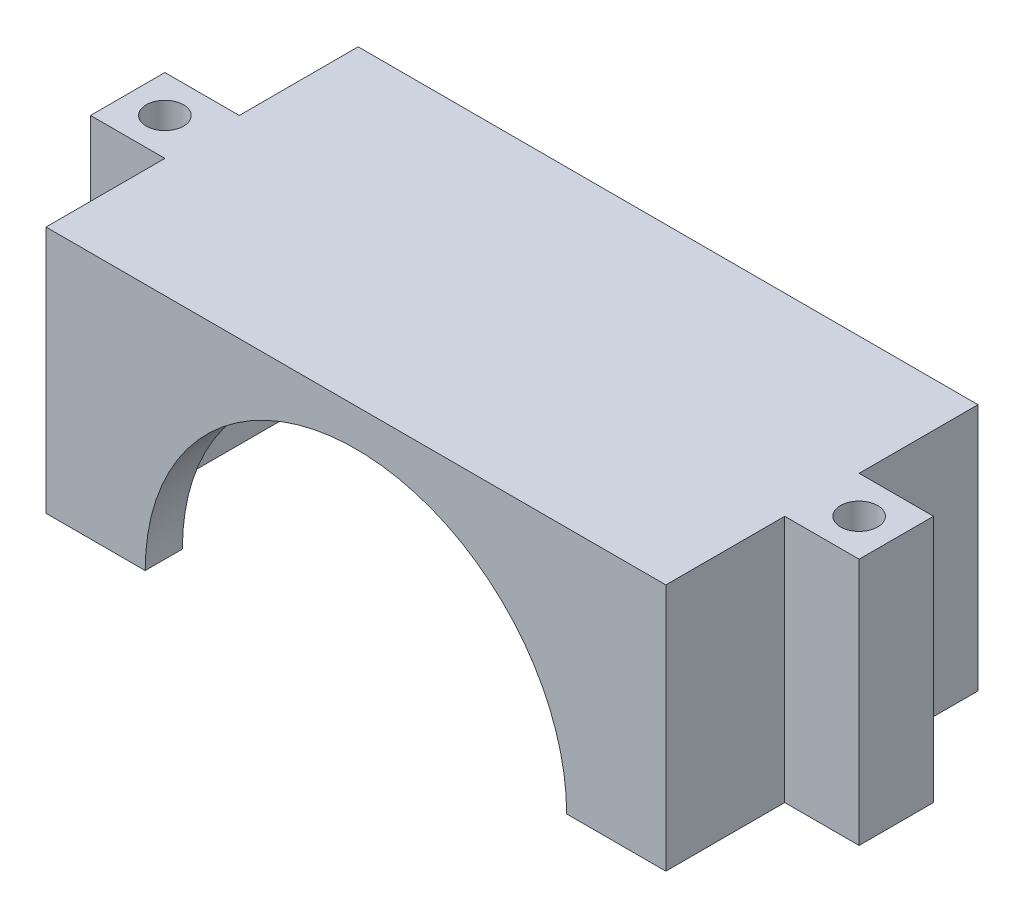
ISO-10303-21;
HEADER;
FILE_DESCRIPTION(('STEP AP214'),'2;1');
FILE_NAME('part.step','',(''),(''),'','','');
FILE_SCHEMA(('AUTOMOTIVE_DESIGN { 1 0 10303 214 1 1 1 1 }'));
ENDSEC;
DATA;
#1=APPLICATION_CONTEXT('core data for automotive mechanical design processes');
#2=APPLICATION_PROTOCOL_DEFINITION('international standard','automotive_design',2000,#1);
#3=PRODUCT_CONTEXT('',#1,'mechanical');
#4=PRODUCT('Part','Part','',(#3));
#5=PRODUCT_RELATED_PRODUCT_CATEGORY('part','',(#4));
#6=PRODUCT_DEFINITION_FORMATION('','',#4);
#7=PRODUCT_DEFINITION_CONTEXT('part definition',#1,'design');
#8=PRODUCT_DEFINITION('design','',#6,#7);
#9=PRODUCT_DEFINITION_SHAPE('','',#8);
#10=(LENGTH_UNIT() NAMED_UNIT(*) SI_UNIT(.MILLI.,.METRE.));
#11=(NAMED_UNIT(*) PLANE_ANGLE_UNIT() SI_UNIT($,.RADIAN.));
#12=(NAMED_UNIT(*) SI_UNIT($,.STERADIAN.) SOLID_ANGLE_UNIT());
#13=UNCERTAINTY_MEASURE_WITH_UNIT(LENGTH_MEASURE(1.E-05),#10,'distance_accuracy_value','');
#14=(GEOMETRIC_REPRESENTATION_CONTEXT(3) GLOBAL_UNCERTAINTY_ASSIGNED_CONTEXT((#13)) GLOBAL_UNIT_ASSIGNED_CONTEXT((#10,
#11,#12)) REPRESENTATION_CONTEXT('',''));
#15=CARTESIAN_POINT('',(0.,0.,0.));
#16=DIRECTION('',(0.,0.,1.));
#17=DIRECTION('',(1.,0.,0.));
#18=AXIS2_PLACEMENT_3D('',#15,#16,#17);
#19=CARTESIAN_POINT('',(-25.,20.,12.59));
#20=DIRECTION('',(1.,0.,0.));
#21=DIRECTION('',(0.,0.,-1.));
#22=AXIS2_PLACEMENT_3D('',#19,#20,#21);
#23=PLANE('',#22);
#24=DIRECTION('',(0.,1.,0.));
#25=VECTOR('',#24,1.);
#26=CARTESIAN_POINT('',(-25.,0.,3.));
#27=LINE('',#26,#25);
#28=CARTESIAN_POINT('',(-25.,0.,3.));
#29=VERTEX_POINT('',#28);
#30=CARTESIAN_POINT('',(-25.,20.,3.));
#31=VERTEX_POINT('',#30);
#32=EDGE_CURVE('E185',#29,#31,#27,.T.);
#33=ORIENTED_EDGE('',*,*,#32,.F.);
#34=DIRECTION('',(0.,0.,1.));
#35=VECTOR('',#34,1.);
#36=CARTESIAN_POINT('',(-25.,0.,12.59));
#37=LINE('',#36,#35);
#38=CARTESIAN_POINT('',(-25.,0.,12.59));
#39=VERTEX_POINT('',#38);
#40=EDGE_CURVE('E198',#29,#39,#37,.T.);
#41=ORIENTED_EDGE('',*,*,#40,.T.);
#42=DIRECTION('',(0.,-1.,0.));
#43=VECTOR('',#42,1.);
#44=CARTESIAN_POINT('',(-25.,20.,12.59));
#45=LINE('',#44,#43);
#46=CARTESIAN_POINT('',(-25.,20.,12.59));
#47=VERTEX_POINT('',#46);
#48=EDGE_CURVE('E235',#47,#39,#45,.T.);
#49=ORIENTED_EDGE('',*,*,#48,.F.);
#50=DIRECTION('',(0.,0.,1.));
#51=VECTOR('',#50,1.);
#52=CARTESIAN_POINT('',(-25.,20.,12.59));
#53=LINE('',#52,#51);
#54=EDGE_CURVE('E200',#31,#47,#53,.T.);
#55=ORIENTED_EDGE('',*,*,#54,.F.);
#56=EDGE_LOOP('',(#33,#41,#49,#55));
#57=FACE_BOUND('',#56,.T.);
#58=ADVANCED_FACE('F35',(#57),#23,.F.);
#59=CARTESIAN_POINT('',(25.,20.,12.59));
#60=DIRECTION('',(-1.,0.,0.));
#61=DIRECTION('',(0.,0.,1.));
#62=AXIS2_PLACEMENT_3D('',#59,#60,#61);
#63=PLANE('',#62);
#64=DIRECTION('',(0.,1.,0.));
#65=VECTOR('',#64,1.);
#66=CARTESIAN_POINT('',(25.,0.,-3.));
#67=LINE('',#66,#65);
#68=CARTESIAN_POINT('',(25.,0.,-3.));
#69=VERTEX_POINT('',#68);
#70=CARTESIAN_POINT('',(25.,20.,-3.));
#71=VERTEX_POINT('',#70);
#72=EDGE_CURVE('E421',#69,#71,#67,.T.);
#73=ORIENTED_EDGE('',*,*,#72,.F.);
#74=DIRECTION('',(0.,0.,-1.));
#75=VECTOR('',#74,1.);
#76=CARTESIAN_POINT('',(25.,0.,12.59));
#77=LINE('',#76,#75);
#78=CARTESIAN_POINT('',(25.,0.,-12.59));
#79=VERTEX_POINT('',#78);
#80=EDGE_CURVE('E248',#69,#79,#77,.T.);
#81=ORIENTED_EDGE('',*,*,#80,.T.);
#82=DIRECTION('',(0.,-1.,0.));
#83=VECTOR('',#82,1.);
#84=CARTESIAN_POINT('',(25.,20.,-12.59));
#85=LINE('',#84,#83);
#86=CARTESIAN_POINT('',(25.,20.,-12.59));
#87=VERTEX_POINT('',#86);
#88=EDGE_CURVE('E241',#87,#79,#85,.T.);
#89=ORIENTED_EDGE('',*,*,#88,.F.);
#90=DIRECTION('',(0.,0.,-1.));
#91=VECTOR('',#90,1.);
#92=CARTESIAN_POINT('',(25.,20.,12.59));
#93=LINE('',#92,#91);
#94=EDGE_CURVE('E231',#71,#87,#93,.T.);
#95=ORIENTED_EDGE('',*,*,#94,.F.);
#96=EDGE_LOOP('',(#73,#81,#89,#95));
#97=FACE_BOUND('',#96,.T.);
#98=ADVANCED_FACE('F314',(#97),#63,.F.);
#99=CARTESIAN_POINT('',(-25.,20.,-12.59));
#100=DIRECTION('',(0.,0.,1.));
#101=DIRECTION('',(1.,0.,0.));
#102=AXIS2_PLACEMENT_3D('',#99,#100,#101);
#103=PLANE('',#102);
#104=DIRECTION('',(0.,-1.,0.));
#105=VECTOR('',#104,1.);
#106=CARTESIAN_POINT('',(12.,0.,-12.59));
#107=LINE('',#106,#105);
#108=CARTESIAN_POINT('',(12.,6.,-12.59));
#109=VERTEX_POINT('',#108);
#110=CARTESIAN_POINT('',(12.,0.,-12.59));
#111=VERTEX_POINT('',#110);
#112=EDGE_CURVE('E346',#109,#111,#107,.T.);
#113=ORIENTED_EDGE('',*,*,#112,.T.);
#114=DIRECTION('',(-1.,0.,0.));
#115=VECTOR('',#114,1.);
#116=CARTESIAN_POINT('',(-25.,0.,-12.59));
#117=LINE('',#116,#115);
#118=CARTESIAN_POINT('',(-25.,0.,-12.59));
#119=VERTEX_POINT('',#118);
#120=EDGE_CURVE('E218',#111,#119,#117,.T.);
#121=ORIENTED_EDGE('',*,*,#120,.T.);
#122=DIRECTION('',(0.,-1.,0.));
#123=VECTOR('',#122,1.);
#124=CARTESIAN_POINT('',(-25.,20.,-12.59));
#125=LINE('',#124,#123);
#126=CARTESIAN_POINT('',(-25.,20.,-12.59));
#127=VERTEX_POINT('',#126);
#128=EDGE_CURVE('E238',#127,#119,#125,.T.);
#129=ORIENTED_EDGE('',*,*,#128,.F.);
#130=DIRECTION('',(-1.,0.,0.));
#131=VECTOR('',#130,1.);
#132=CARTESIAN_POINT('',(-25.,20.,-12.59));
#133=LINE('',#132,#131);
#134=EDGE_CURVE('E255',#87,#127,#133,.T.);
#135=ORIENTED_EDGE('',*,*,#134,.F.);
#136=ORIENTED_EDGE('',*,*,#88,.T.);
#137=CARTESIAN_POINT('',(22.,0.,-12.59));
#138=VERTEX_POINT('',#137);
#139=EDGE_CURVE('E212',#79,#138,#117,.T.);
#140=ORIENTED_EDGE('',*,*,#139,.T.);
#141=DIRECTION('',(0.,-1.,0.));
#142=VECTOR('',#141,1.);
#143=CARTESIAN_POINT('',(22.,0.,-12.59));
#144=LINE('',#143,#142);
#145=CARTESIAN_POINT('',(22.,6.,-12.59));
#146=VERTEX_POINT('',#145);
#147=EDGE_CURVE('E353',#146,#138,#144,.T.);
#148=ORIENTED_EDGE('',*,*,#147,.F.);
#149=DIRECTION('',(-1.,0.,0.));
#150=VECTOR('',#149,1.);
#151=CARTESIAN_POINT('',(0.,6.,-12.59));
#152=LINE('',#151,#150);
#153=EDGE_CURVE('E349',#146,#109,#152,.T.);
#154=ORIENTED_EDGE('',*,*,#153,.T.);
#155=EDGE_LOOP('',(#113,#121,#129,#135,#136,#140,#148,#154));
#156=FACE_BOUND('',#155,.T.);
#157=ADVANCED_FACE('F321',(#156),#103,.F.);
#158=CARTESIAN_POINT('',(0.,0.,0.));
#159=DIRECTION('',(0.,-1.,0.));
#160=DIRECTION('',(0.,0.,-1.));
#161=AXIS2_PLACEMENT_3D('',#158,#159,#160);
#162=PLANE('',#161);
#163=ORIENTED_EDGE('',*,*,#120,.F.);
#164=DIRECTION('',(0.,0.,-1.));
#165=VECTOR('',#164,1.);
#166=CARTESIAN_POINT('',(12.,0.,4.41));
#167=LINE('',#166,#165);
#168=CARTESIAN_POINT('',(12.,0.,-9.59));
#169=VERTEX_POINT('',#168);
#170=EDGE_CURVE('E339',#169,#111,#167,.T.);
#171=ORIENTED_EDGE('',*,*,#170,.F.);
#172=DIRECTION('',(1.,0.,0.));
#173=VECTOR('',#172,1.);
#174=CARTESIAN_POINT('',(-22.,0.,-9.59));
#175=LINE('',#174,#173);
#176=CARTESIAN_POINT('',(-22.,0.,-9.59));
#177=VERTEX_POINT('',#176);
#178=EDGE_CURVE('E377',#177,#169,#175,.T.);
#179=ORIENTED_EDGE('',*,*,#178,.F.);
#180=DIRECTION('',(0.,0.,-1.));
#181=VECTOR('',#180,1.);
#182=CARTESIAN_POINT('',(-22.,0.,-9.59));
#183=LINE('',#182,#181);
#184=CARTESIAN_POINT('',(-22.,0.,9.59));
#185=VERTEX_POINT('',#184);
#186=EDGE_CURVE('E393',#185,#177,#183,.T.);
#187=ORIENTED_EDGE('',*,*,#186,.F.);
#188=DIRECTION('',(-1.,0.,0.));
#189=VECTOR('',#188,1.);
#190=CARTESIAN_POINT('',(-22.,0.,9.59));
#191=LINE('',#190,#189);
#192=CARTESIAN_POINT('',(-17.,0.,9.59));
#193=VERTEX_POINT('',#192);
#194=EDGE_CURVE('E389',#193,#185,#191,.T.);
#195=ORIENTED_EDGE('',*,*,#194,.F.);
#196=DIRECTION('',(0.,0.,1.));
#197=VECTOR('',#196,1.);
#198=CARTESIAN_POINT('',(-17.,0.,-28.4231556174964));
#199=LINE('',#198,#197);
#200=CARTESIAN_POINT('',(-17.,0.,12.59));
#201=VERTEX_POINT('',#200);
#202=EDGE_CURVE('E369',#193,#201,#199,.T.);
#203=ORIENTED_EDGE('',*,*,#202,.T.);
#204=DIRECTION('',(1.,0.,0.));
#205=VECTOR('',#204,1.);
#206=CARTESIAN_POINT('',(-25.,0.,12.59));
#207=LINE('',#206,#205);
#208=EDGE_CURVE('E210',#39,#201,#207,.T.);
#209=ORIENTED_EDGE('',*,*,#208,.F.);
#210=ORIENTED_EDGE('',*,*,#40,.F.);
#211=DIRECTION('',(1.,0.,0.));
#212=VECTOR('',#211,1.);
#213=CARTESIAN_POINT('',(-25.,0.,3.));
#214=LINE('',#213,#212);
#215=CARTESIAN_POINT('',(-31.,0.,3.));
#216=VERTEX_POINT('',#215);
#217=EDGE_CURVE('E181',#216,#29,#214,.T.);
#218=ORIENTED_EDGE('',*,*,#217,.F.);
#219=DIRECTION('',(0.,0.,1.));
#220=VECTOR('',#219,1.);
#221=CARTESIAN_POINT('',(-31.,0.,3.));
#222=LINE('',#221,#220);
#223=CARTESIAN_POINT('',(-31.,0.,-3.));
#224=VERTEX_POINT('',#223);
#225=EDGE_CURVE('E202',#224,#216,#222,.T.);
#226=ORIENTED_EDGE('',*,*,#225,.F.);
#227=DIRECTION('',(-1.,0.,0.));
#228=VECTOR('',#227,1.);
#229=CARTESIAN_POINT('',(-25.,0.,-3.));
#230=LINE('',#229,#228);
#231=CARTESIAN_POINT('',(-25.,0.,-3.));
#232=VERTEX_POINT('',#231);
#233=EDGE_CURVE('E192',#232,#224,#230,.T.);
#234=ORIENTED_EDGE('',*,*,#233,.F.);
#235=EDGE_CURVE('E211',#119,#232,#37,.T.);
#236=ORIENTED_EDGE('',*,*,#235,.F.);
#237=EDGE_LOOP('',(#163,#171,#179,#187,#195,#203,#209,#210,#218,#226,#234,#236));
#238=FACE_BOUND('',#237,.T.);
#239=CARTESIAN_POINT('',(-28.,0.,0.));
#240=DIRECTION('',(0.,1.,0.));
#241=DIRECTION('',(0.,0.,-1.));
#242=AXIS2_PLACEMENT_3D('',#239,#240,#241);
#243=CIRCLE('',#242,1.5);
#244=CARTESIAN_POINT('',(-28.,0.,-1.5));
#245=VERTEX_POINT('',#244);
#246=EDGE_CURVE('E278',#245,#245,#243,.T.);
#247=ORIENTED_EDGE('',*,*,#246,.T.);
#248=EDGE_LOOP('',(#247));
#249=FACE_BOUND('',#248,.T.);
#250=ADVANCED_FACE('F206',(#238,#249),#162,.T.);
#251=CARTESIAN_POINT('',(-22.,17.,-9.59));
#252=DIRECTION('',(0.,0.,-1.));
#253=DIRECTION('',(-1.,0.,0.));
#254=AXIS2_PLACEMENT_3D('',#251,#252,#253);
#255=PLANE('',#254);
#256=DIRECTION('',(-1.,0.,0.));
#257=VECTOR('',#256,1.);
#258=CARTESIAN_POINT('',(-22.,6.,-9.59));
#259=LINE('',#258,#257);
#260=CARTESIAN_POINT('',(22.,6.,-9.59));
#261=VERTEX_POINT('',#260);
#262=CARTESIAN_POINT('',(12.,6.,-9.59));
#263=VERTEX_POINT('',#262);
#264=EDGE_CURVE('E11',#261,#263,#259,.T.);
#265=ORIENTED_EDGE('',*,*,#264,.F.);
#266=DIRECTION('',(0.,-1.,0.));
#267=VECTOR('',#266,1.);
#268=CARTESIAN_POINT('',(22.,17.,-9.59));
#269=LINE('',#268,#267);
#270=CARTESIAN_POINT('',(22.,17.,-9.59));
#271=VERTEX_POINT('',#270);
#272=EDGE_CURVE('E397',#271,#261,#269,.T.);
#273=ORIENTED_EDGE('',*,*,#272,.F.);
#274=DIRECTION('',(1.,0.,0.));
#275=VECTOR('',#274,1.);
#276=CARTESIAN_POINT('',(-22.,17.,-9.59));
#277=LINE('',#276,#275);
#278=CARTESIAN_POINT('',(-22.,17.,-9.59));
#279=VERTEX_POINT('',#278);
#280=EDGE_CURVE('E384',#279,#271,#277,.T.);
#281=ORIENTED_EDGE('',*,*,#280,.F.);
#282=DIRECTION('',(0.,-1.,0.));
#283=VECTOR('',#282,1.);
#284=CARTESIAN_POINT('',(-22.,17.,-9.59));
#285=LINE('',#284,#283);
#286=EDGE_CURVE('E400',#279,#177,#285,.T.);
#287=ORIENTED_EDGE('',*,*,#286,.T.);
#288=ORIENTED_EDGE('',*,*,#178,.T.);
#289=DIRECTION('',(0.,-1.,0.));
#290=VECTOR('',#289,1.);
#291=CARTESIAN_POINT('',(12.,17.,-9.59));
#292=LINE('',#291,#290);
#293=EDGE_CURVE('E44',#263,#169,#292,.T.);
#294=ORIENTED_EDGE('',*,*,#293,.F.);
#295=EDGE_LOOP('',(#265,#273,#281,#287,#288,#294));
#296=FACE_BOUND('',#295,.T.);
#297=ADVANCED_FACE('F550',(#296),#255,.F.);
#298=CARTESIAN_POINT('',(-22.,17.,9.59));
#299=DIRECTION('',(0.,0.,1.));
#300=DIRECTION('',(1.,0.,0.));
#301=AXIS2_PLACEMENT_3D('',#298,#299,#300);
#302=PLANE('',#301);
#303=CARTESIAN_POINT('',(22.,0.,9.59));
#304=VERTEX_POINT('',#303);
#305=CARTESIAN_POINT('',(17.,0.,9.58999999999998));
#306=VERTEX_POINT('',#305);
#307=EDGE_CURVE('E390',#304,#306,#191,.T.);
#308=ORIENTED_EDGE('',*,*,#307,.T.);
#309=CARTESIAN_POINT('',(0.,0.,9.59));
#310=DIRECTION('',(0.,0.,1.));
#311=DIRECTION('',(1.,0.,0.));
#312=AXIS2_PLACEMENT_3D('',#309,#310,#311);
#313=CIRCLE('',#312,17.);
#314=CARTESIAN_POINT('',(0.,17.,9.59));
#315=VERTEX_POINT('',#314);
#316=EDGE_CURVE('E367',#315,#306,#313,.F.);
#317=ORIENTED_EDGE('',*,*,#316,.F.);
#318=DIRECTION('',(-1.,0.,0.));
#319=VECTOR('',#318,1.);
#320=CARTESIAN_POINT('',(-22.,17.,9.59));
#321=LINE('',#320,#319);
#322=CARTESIAN_POINT('',(22.,17.,9.59));
#323=VERTEX_POINT('',#322);
#324=EDGE_CURVE('E378',#323,#315,#321,.T.);
#325=ORIENTED_EDGE('',*,*,#324,.F.);
#326=DIRECTION('',(0.,-1.,0.));
#327=VECTOR('',#326,1.);
#328=CARTESIAN_POINT('',(22.,17.,9.59));
#329=LINE('',#328,#327);
#330=EDGE_CURVE('E387',#323,#304,#329,.T.);
#331=ORIENTED_EDGE('',*,*,#330,.T.);
#332=EDGE_LOOP('',(#308,#317,#325,#331));
#333=FACE_BOUND('',#332,.T.);
#334=ADVANCED_FACE('F333',(#333),#302,.F.);
#335=CARTESIAN_POINT('',(25.,0.,12.59));
#336=VERTEX_POINT('',#335);
#337=CARTESIAN_POINT('',(25.,0.,3.));
#338=VERTEX_POINT('',#337);
#339=EDGE_CURVE('E245',#336,#338,#77,.T.);
#340=ORIENTED_EDGE('',*,*,#339,.T.);
#341=DIRECTION('',(0.,1.,0.));
#342=VECTOR('',#341,1.);
#343=CARTESIAN_POINT('',(25.,0.,3.));
#344=LINE('',#343,#342);
#345=CARTESIAN_POINT('',(25.,20.,3.));
#346=VERTEX_POINT('',#345);
#347=EDGE_CURVE('E441',#338,#346,#344,.T.);
#348=ORIENTED_EDGE('',*,*,#347,.T.);
#349=CARTESIAN_POINT('',(25.,20.,12.59));
#350=VERTEX_POINT('',#349);
#351=EDGE_CURVE('E410',#350,#346,#93,.T.);
#352=ORIENTED_EDGE('',*,*,#351,.F.);
#353=DIRECTION('',(0.,-1.,0.));
#354=VECTOR('',#353,1.);
#355=CARTESIAN_POINT('',(25.,20.,12.59));
#356=LINE('',#355,#354);
#357=EDGE_CURVE('E232',#350,#336,#356,.T.);
#358=ORIENTED_EDGE('',*,*,#357,.T.);
#359=EDGE_LOOP('',(#340,#348,#352,#358));
#360=FACE_BOUND('',#359,.T.);
#361=ADVANCED_FACE('F37',(#360),#63,.F.);
#362=ORIENTED_EDGE('',*,*,#235,.T.);
#363=DIRECTION('',(0.,1.,0.));
#364=VECTOR('',#363,1.);
#365=CARTESIAN_POINT('',(-25.,0.,-3.));
#366=LINE('',#365,#364);
#367=CARTESIAN_POINT('',(-25.,20.,-3.));
#368=VERTEX_POINT('',#367);
#369=EDGE_CURVE('E201',#232,#368,#366,.T.);
#370=ORIENTED_EDGE('',*,*,#369,.T.);
#371=EDGE_CURVE('E223',#127,#368,#53,.T.);
#372=ORIENTED_EDGE('',*,*,#371,.F.);
#373=ORIENTED_EDGE('',*,*,#128,.T.);
#374=EDGE_LOOP('',(#362,#370,#372,#373));
#375=FACE_BOUND('',#374,.T.);
#376=ADVANCED_FACE('F316',(#375),#23,.F.);
#377=CARTESIAN_POINT('',(-25.,20.,12.59));
#378=DIRECTION('',(0.,0.,-1.));
#379=DIRECTION('',(-1.,0.,0.));
#380=AXIS2_PLACEMENT_3D('',#377,#378,#379);
#381=PLANE('',#380);
#382=ORIENTED_EDGE('',*,*,#208,.T.);
#383=CARTESIAN_POINT('',(0.,0.,12.59));
#384=DIRECTION('',(0.,0.,1.));
#385=DIRECTION('',(1.,0.,0.));
#386=AXIS2_PLACEMENT_3D('',#383,#384,#385);
#387=CIRCLE('',#386,17.);
#388=CARTESIAN_POINT('',(17.,0.,12.59));
#389=VERTEX_POINT('',#388);
#390=EDGE_CURVE('E362',#389,#201,#387,.T.);
#391=ORIENTED_EDGE('',*,*,#390,.F.);
#392=EDGE_CURVE('E215',#389,#336,#207,.T.);
#393=ORIENTED_EDGE('',*,*,#392,.T.);
#394=ORIENTED_EDGE('',*,*,#357,.F.);
#395=DIRECTION('',(1.,0.,0.));
#396=VECTOR('',#395,1.);
#397=CARTESIAN_POINT('',(-25.,20.,12.59));
#398=LINE('',#397,#396);
#399=EDGE_CURVE('E236',#47,#350,#398,.T.);
#400=ORIENTED_EDGE('',*,*,#399,.F.);
#401=ORIENTED_EDGE('',*,*,#48,.T.);
#402=EDGE_LOOP('',(#382,#391,#393,#394,#400,#401));
#403=FACE_BOUND('',#402,.T.);
#404=ADVANCED_FACE('F325',(#403),#381,.F.);
#405=CARTESIAN_POINT('',(0.,20.,0.));
#406=DIRECTION('',(0.,-1.,0.));
#407=DIRECTION('',(0.,0.,-1.));
#408=AXIS2_PLACEMENT_3D('',#405,#406,#407);
#409=PLANE('',#408);
#410=ORIENTED_EDGE('',*,*,#351,.T.);
#411=DIRECTION('',(1.,0.,0.));
#412=VECTOR('',#411,1.);
#413=CARTESIAN_POINT('',(25.,20.,3.));
#414=LINE('',#413,#412);
#415=CARTESIAN_POINT('',(31.,20.,3.));
#416=VERTEX_POINT('',#415);
#417=EDGE_CURVE('E60',#346,#416,#414,.T.);
#418=ORIENTED_EDGE('',*,*,#417,.T.);
#419=DIRECTION('',(0.,0.,-1.));
#420=VECTOR('',#419,1.);
#421=CARTESIAN_POINT('',(31.,20.,3.));
#422=LINE('',#421,#420);
#423=CARTESIAN_POINT('',(31.,20.,-3.));
#424=VERTEX_POINT('',#423);
#425=EDGE_CURVE('E456',#416,#424,#422,.T.);
#426=ORIENTED_EDGE('',*,*,#425,.T.);
#427=DIRECTION('',(-1.,0.,0.));
#428=VECTOR('',#427,1.);
#429=CARTESIAN_POINT('',(25.,20.,-3.));
#430=LINE('',#429,#428);
#431=EDGE_CURVE('E416',#424,#71,#430,.T.);
#432=ORIENTED_EDGE('',*,*,#431,.T.);
#433=ORIENTED_EDGE('',*,*,#94,.T.);
#434=ORIENTED_EDGE('',*,*,#134,.T.);
#435=ORIENTED_EDGE('',*,*,#371,.T.);
#436=DIRECTION('',(-1.,0.,0.));
#437=VECTOR('',#436,1.);
#438=CARTESIAN_POINT('',(-25.,20.,-3.));
#439=LINE('',#438,#437);
#440=CARTESIAN_POINT('',(-31.,20.,-3.));
#441=VERTEX_POINT('',#440);
#442=EDGE_CURVE('E52',#368,#441,#439,.T.);
#443=ORIENTED_EDGE('',*,*,#442,.T.);
#444=DIRECTION('',(0.,0.,1.));
#445=VECTOR('',#444,1.);
#446=CARTESIAN_POINT('',(-31.,20.,3.));
#447=LINE('',#446,#445);
#448=CARTESIAN_POINT('',(-31.,20.,3.));
#449=VERTEX_POINT('',#448);
#450=EDGE_CURVE('E193',#441,#449,#447,.T.);
#451=ORIENTED_EDGE('',*,*,#450,.T.);
#452=DIRECTION('',(1.,0.,0.));
#453=VECTOR('',#452,1.);
#454=CARTESIAN_POINT('',(-25.,20.,3.));
#455=LINE('',#454,#453);
#456=EDGE_CURVE('E260',#449,#31,#455,.T.);
#457=ORIENTED_EDGE('',*,*,#456,.T.);
#458=ORIENTED_EDGE('',*,*,#54,.T.);
#459=ORIENTED_EDGE('',*,*,#399,.T.);
#460=EDGE_LOOP('',(#410,#418,#426,#432,#433,#434,#435,#443,#451,#457,#458,#459));
#461=FACE_BOUND('',#460,.T.);
#462=CARTESIAN_POINT('',(28.,20.,0.));
#463=DIRECTION('',(0.,1.,0.));
#464=DIRECTION('',(0.,0.,1.));
#465=AXIS2_PLACEMENT_3D('',#462,#463,#464);
#466=CIRCLE('',#465,1.5);
#467=CARTESIAN_POINT('',(28.,20.,1.5));
#468=VERTEX_POINT('',#467);
#469=EDGE_CURVE('E289',#468,#468,#466,.T.);
#470=ORIENTED_EDGE('',*,*,#469,.F.);
#471=EDGE_LOOP('',(#470));
#472=FACE_BOUND('',#471,.T.);
#473=CARTESIAN_POINT('',(-28.,20.,0.));
#474=DIRECTION('',(0.,1.,0.));
#475=DIRECTION('',(0.,0.,-1.));
#476=AXIS2_PLACEMENT_3D('',#473,#474,#475);
#477=CIRCLE('',#476,1.5);
#478=CARTESIAN_POINT('',(-28.,20.,-1.5));
#479=VERTEX_POINT('',#478);
#480=EDGE_CURVE('E282',#479,#479,#477,.T.);
#481=ORIENTED_EDGE('',*,*,#480,.F.);
#482=EDGE_LOOP('',(#481));
#483=FACE_BOUND('',#482,.T.);
#484=ADVANCED_FACE('F298',(#461,#472,#483),#409,.F.);
#485=DIRECTION('',(0.,0.,1.));
#486=VECTOR('',#485,1.);
#487=CARTESIAN_POINT('',(22.,0.,-9.59));
#488=LINE('',#487,#486);
#489=EDGE_CURVE('E366',#138,#304,#488,.T.);
#490=ORIENTED_EDGE('',*,*,#489,.F.);
#491=ORIENTED_EDGE('',*,*,#139,.F.);
#492=ORIENTED_EDGE('',*,*,#80,.F.);
#493=DIRECTION('',(-1.,0.,0.));
#494=VECTOR('',#493,1.);
#495=CARTESIAN_POINT('',(25.,0.,-3.));
#496=LINE('',#495,#494);
#497=CARTESIAN_POINT('',(31.,0.,-3.));
#498=VERTEX_POINT('',#497);
#499=EDGE_CURVE('E444',#498,#69,#496,.T.);
#500=ORIENTED_EDGE('',*,*,#499,.F.);
#501=DIRECTION('',(0.,0.,-1.));
#502=VECTOR('',#501,1.);
#503=CARTESIAN_POINT('',(31.,0.,3.));
#504=LINE('',#503,#502);
#505=CARTESIAN_POINT('',(31.,0.,3.));
#506=VERTEX_POINT('',#505);
#507=EDGE_CURVE('E449',#506,#498,#504,.T.);
#508=ORIENTED_EDGE('',*,*,#507,.F.);
#509=DIRECTION('',(1.,0.,0.));
#510=VECTOR('',#509,1.);
#511=CARTESIAN_POINT('',(25.,0.,3.));
#512=LINE('',#511,#510);
#513=EDGE_CURVE('E446',#338,#506,#512,.T.);
#514=ORIENTED_EDGE('',*,*,#513,.F.);
#515=ORIENTED_EDGE('',*,*,#339,.F.);
#516=ORIENTED_EDGE('',*,*,#392,.F.);
#517=DIRECTION('',(0.,0.,1.));
#518=VECTOR('',#517,1.);
#519=CARTESIAN_POINT('',(17.,0.,-28.4231556174964));
#520=LINE('',#519,#518);
#521=EDGE_CURVE('E370',#306,#389,#520,.T.);
#522=ORIENTED_EDGE('',*,*,#521,.F.);
#523=ORIENTED_EDGE('',*,*,#307,.F.);
#524=EDGE_LOOP('',(#490,#491,#492,#500,#508,#514,#515,#516,#522,#523));
#525=FACE_BOUND('',#524,.T.);
#526=CARTESIAN_POINT('',(28.,0.,0.));
#527=DIRECTION('',(0.,1.,0.));
#528=DIRECTION('',(0.,0.,1.));
#529=AXIS2_PLACEMENT_3D('',#526,#527,#528);
#530=CIRCLE('',#529,1.5);
#531=CARTESIAN_POINT('',(28.,0.,1.5));
#532=VERTEX_POINT('',#531);
#533=EDGE_CURVE('E273',#532,#532,#530,.T.);
#534=ORIENTED_EDGE('',*,*,#533,.T.);
#535=EDGE_LOOP('',(#534));
#536=FACE_BOUND('',#535,.T.);
#537=ADVANCED_FACE('F424',(#525,#536),#162,.T.);
#538=CARTESIAN_POINT('',(22.,17.,-9.59));
#539=DIRECTION('',(1.,0.,0.));
#540=DIRECTION('',(0.,0.,-1.));
#541=AXIS2_PLACEMENT_3D('',#538,#539,#540);
#542=PLANE('',#541);
#543=ORIENTED_EDGE('',*,*,#272,.T.);
#544=DIRECTION('',(0.,0.,-1.));
#545=VECTOR('',#544,1.);
#546=CARTESIAN_POINT('',(22.,6.,4.41));
#547=LINE('',#546,#545);
#548=EDGE_CURVE('E352',#261,#146,#547,.T.);
#549=ORIENTED_EDGE('',*,*,#548,.T.);
#550=ORIENTED_EDGE('',*,*,#147,.T.);
#551=ORIENTED_EDGE('',*,*,#489,.T.);
#552=ORIENTED_EDGE('',*,*,#330,.F.);
#553=DIRECTION('',(0.,0.,1.));
#554=VECTOR('',#553,1.);
#555=CARTESIAN_POINT('',(22.,17.,-9.59));
#556=LINE('',#555,#554);
#557=EDGE_CURVE('E373',#271,#323,#556,.T.);
#558=ORIENTED_EDGE('',*,*,#557,.F.);
#559=EDGE_LOOP('',(#543,#549,#550,#551,#552,#558));
#560=FACE_BOUND('',#559,.T.);
#561=ADVANCED_FACE('F428',(#560),#542,.F.);
#562=CARTESIAN_POINT('',(-22.,17.,-9.59));
#563=DIRECTION('',(-1.,0.,0.));
#564=DIRECTION('',(0.,0.,1.));
#565=AXIS2_PLACEMENT_3D('',#562,#563,#564);
#566=PLANE('',#565);
#567=ORIENTED_EDGE('',*,*,#186,.T.);
#568=ORIENTED_EDGE('',*,*,#286,.F.);
#569=DIRECTION('',(0.,0.,-1.));
#570=VECTOR('',#569,1.);
#571=CARTESIAN_POINT('',(-22.,17.,-9.59));
#572=LINE('',#571,#570);
#573=CARTESIAN_POINT('',(-22.,17.,9.59));
#574=VERTEX_POINT('',#573);
#575=EDGE_CURVE('E381',#574,#279,#572,.T.);
#576=ORIENTED_EDGE('',*,*,#575,.F.);
#577=DIRECTION('',(0.,-1.,0.));
#578=VECTOR('',#577,1.);
#579=CARTESIAN_POINT('',(-22.,17.,9.59));
#580=LINE('',#579,#578);
#581=EDGE_CURVE('E402',#574,#185,#580,.T.);
#582=ORIENTED_EDGE('',*,*,#581,.T.);
#583=EDGE_LOOP('',(#567,#568,#576,#582));
#584=FACE_BOUND('',#583,.T.);
#585=ADVANCED_FACE('F597',(#584),#566,.F.);
#586=EDGE_CURVE('E376',#315,#574,#321,.T.);
#587=ORIENTED_EDGE('',*,*,#586,.F.);
#588=EDGE_CURVE('E364',#193,#315,#313,.F.);
#589=ORIENTED_EDGE('',*,*,#588,.F.);
#590=ORIENTED_EDGE('',*,*,#194,.T.);
#591=ORIENTED_EDGE('',*,*,#581,.F.);
#592=EDGE_LOOP('',(#587,#589,#590,#591));
#593=FACE_BOUND('',#592,.T.);
#594=ADVANCED_FACE('F589',(#593),#302,.F.);
#595=CARTESIAN_POINT('',(0.,17.,0.));
#596=DIRECTION('',(0.,1.,0.));
#597=DIRECTION('',(0.,0.,1.));
#598=AXIS2_PLACEMENT_3D('',#595,#596,#597);
#599=PLANE('',#598);
#600=ORIENTED_EDGE('',*,*,#557,.T.);
#601=ORIENTED_EDGE('',*,*,#324,.T.);
#602=ORIENTED_EDGE('',*,*,#586,.T.);
#603=ORIENTED_EDGE('',*,*,#575,.T.);
#604=ORIENTED_EDGE('',*,*,#280,.T.);
#605=EDGE_LOOP('',(#600,#601,#602,#603,#604));
#606=FACE_BOUND('',#605,.T.);
#607=ADVANCED_FACE('F580',(#606),#599,.F.);
#608=CARTESIAN_POINT('',(0.,0.,-28.4231556174964));
#609=DIRECTION('',(0.,0.,1.));
#610=DIRECTION('',(1.,0.,0.));
#611=AXIS2_PLACEMENT_3D('',#608,#609,#610);
#612=CYLINDRICAL_SURFACE('',#611,17.);
#613=ORIENTED_EDGE('',*,*,#588,.T.);
#614=ORIENTED_EDGE('',*,*,#316,.T.);
#615=ORIENTED_EDGE('',*,*,#521,.T.);
#616=ORIENTED_EDGE('',*,*,#390,.T.);
#617=ORIENTED_EDGE('',*,*,#202,.F.);
#618=EDGE_LOOP('',(#613,#614,#615,#616,#617));
#619=FACE_BOUND('',#618,.T.);
#620=ADVANCED_FACE('F572',(#619),#612,.F.);
#621=CARTESIAN_POINT('',(0.,6.,4.41));
#622=DIRECTION('',(0.,-1.,0.));
#623=DIRECTION('',(0.,0.,-1.));
#624=AXIS2_PLACEMENT_3D('',#621,#622,#623);
#625=PLANE('',#624);
#626=ORIENTED_EDGE('',*,*,#264,.T.);
#627=DIRECTION('',(0.,0.,-1.));
#628=VECTOR('',#627,1.);
#629=CARTESIAN_POINT('',(12.,6.,4.41));
#630=LINE('',#629,#628);
#631=EDGE_CURVE('E360',#263,#109,#630,.T.);
#632=ORIENTED_EDGE('',*,*,#631,.T.);
#633=ORIENTED_EDGE('',*,*,#153,.F.);
#634=ORIENTED_EDGE('',*,*,#548,.F.);
#635=EDGE_LOOP('',(#626,#632,#633,#634));
#636=FACE_BOUND('',#635,.T.);
#637=ADVANCED_FACE('F432',(#636),#625,.T.);
#638=CARTESIAN_POINT('',(12.,0.,4.41));
#639=DIRECTION('',(1.,0.,0.));
#640=DIRECTION('',(0.,0.,-1.));
#641=AXIS2_PLACEMENT_3D('',#638,#639,#640);
#642=PLANE('',#641);
#643=ORIENTED_EDGE('',*,*,#293,.T.);
#644=ORIENTED_EDGE('',*,*,#170,.T.);
#645=ORIENTED_EDGE('',*,*,#112,.F.);
#646=ORIENTED_EDGE('',*,*,#631,.F.);
#647=EDGE_LOOP('',(#643,#644,#645,#646));
#648=FACE_BOUND('',#647,.T.);
#649=ADVANCED_FACE('F527',(#648),#642,.T.);
#650=CARTESIAN_POINT('',(25.,0.,-3.));
#651=DIRECTION('',(0.,0.,-1.));
#652=DIRECTION('',(-1.,0.,0.));
#653=AXIS2_PLACEMENT_3D('',#650,#651,#652);
#654=PLANE('',#653);
#655=ORIENTED_EDGE('',*,*,#431,.F.);
#656=DIRECTION('',(0.,1.,0.));
#657=VECTOR('',#656,1.);
#658=CARTESIAN_POINT('',(31.,0.,-3.));
#659=LINE('',#658,#657);
#660=EDGE_CURVE('E433',#498,#424,#659,.T.);
#661=ORIENTED_EDGE('',*,*,#660,.F.);
#662=ORIENTED_EDGE('',*,*,#499,.T.);
#663=ORIENTED_EDGE('',*,*,#72,.T.);
#664=EDGE_LOOP('',(#655,#661,#662,#663));
#665=FACE_BOUND('',#664,.T.);
#666=ADVANCED_FACE('F518',(#665),#654,.T.);
#667=CARTESIAN_POINT('',(31.,0.,3.));
#668=DIRECTION('',(1.,0.,0.));
#669=DIRECTION('',(0.,0.,-1.));
#670=AXIS2_PLACEMENT_3D('',#667,#668,#669);
#671=PLANE('',#670);
#672=ORIENTED_EDGE('',*,*,#425,.F.);
#673=DIRECTION('',(0.,1.,0.));
#674=VECTOR('',#673,1.);
#675=CARTESIAN_POINT('',(31.,0.,3.));
#676=LINE('',#675,#674);
#677=EDGE_CURVE('E438',#506,#416,#676,.T.);
#678=ORIENTED_EDGE('',*,*,#677,.F.);
#679=ORIENTED_EDGE('',*,*,#507,.T.);
#680=ORIENTED_EDGE('',*,*,#660,.T.);
#681=EDGE_LOOP('',(#672,#678,#679,#680));
#682=FACE_BOUND('',#681,.T.);
#683=ADVANCED_FACE('F464',(#682),#671,.T.);
#684=CARTESIAN_POINT('',(25.,0.,3.));
#685=DIRECTION('',(0.,0.,1.));
#686=DIRECTION('',(1.,0.,0.));
#687=AXIS2_PLACEMENT_3D('',#684,#685,#686);
#688=PLANE('',#687);
#689=ORIENTED_EDGE('',*,*,#417,.F.);
#690=ORIENTED_EDGE('',*,*,#347,.F.);
#691=ORIENTED_EDGE('',*,*,#513,.T.);
#692=ORIENTED_EDGE('',*,*,#677,.T.);
#693=EDGE_LOOP('',(#689,#690,#691,#692));
#694=FACE_BOUND('',#693,.T.);
#695=ADVANCED_FACE('F461',(#694),#688,.T.);
#696=CARTESIAN_POINT('',(28.,0.,0.));
#697=DIRECTION('',(0.,1.,0.));
#698=DIRECTION('',(0.,0.,1.));
#699=AXIS2_PLACEMENT_3D('',#696,#697,#698);
#700=CYLINDRICAL_SURFACE('',#699,1.5);
#701=ORIENTED_EDGE('',*,*,#533,.F.);
#702=EDGE_LOOP('',(#701));
#703=FACE_BOUND('',#702,.T.);
#704=ORIENTED_EDGE('',*,*,#469,.T.);
#705=EDGE_LOOP('',(#704));
#706=FACE_BOUND('',#705,.T.);
#707=ADVANCED_FACE('F310',(#703,#706),#700,.F.);
#708=CARTESIAN_POINT('',(-25.,0.,3.));
#709=DIRECTION('',(0.,0.,1.));
#710=DIRECTION('',(1.,0.,0.));
#711=AXIS2_PLACEMENT_3D('',#708,#709,#710);
#712=PLANE('',#711);
#713=ORIENTED_EDGE('',*,*,#456,.F.);
#714=DIRECTION('',(0.,1.,0.));
#715=VECTOR('',#714,1.);
#716=CARTESIAN_POINT('',(-31.,0.,3.));
#717=LINE('',#716,#715);
#718=EDGE_CURVE('E187',#216,#449,#717,.T.);
#719=ORIENTED_EDGE('',*,*,#718,.F.);
#720=ORIENTED_EDGE('',*,*,#217,.T.);
#721=ORIENTED_EDGE('',*,*,#32,.T.);
#722=EDGE_LOOP('',(#713,#719,#720,#721));
#723=FACE_BOUND('',#722,.T.);
#724=ADVANCED_FACE('F184',(#723),#712,.T.);
#725=CARTESIAN_POINT('',(-31.,0.,3.));
#726=DIRECTION('',(-1.,0.,0.));
#727=DIRECTION('',(0.,0.,1.));
#728=AXIS2_PLACEMENT_3D('',#725,#726,#727);
#729=PLANE('',#728);
#730=ORIENTED_EDGE('',*,*,#450,.F.);
#731=DIRECTION('',(0.,1.,0.));
#732=VECTOR('',#731,1.);
#733=CARTESIAN_POINT('',(-31.,0.,-3.));
#734=LINE('',#733,#732);
#735=EDGE_CURVE('E265',#224,#441,#734,.T.);
#736=ORIENTED_EDGE('',*,*,#735,.F.);
#737=ORIENTED_EDGE('',*,*,#225,.T.);
#738=ORIENTED_EDGE('',*,*,#718,.T.);
#739=EDGE_LOOP('',(#730,#736,#737,#738));
#740=FACE_BOUND('',#739,.T.);
#741=ADVANCED_FACE('F301',(#740),#729,.T.);
#742=CARTESIAN_POINT('',(-25.,0.,-3.));
#743=DIRECTION('',(0.,0.,-1.));
#744=DIRECTION('',(-1.,0.,0.));
#745=AXIS2_PLACEMENT_3D('',#742,#743,#744);
#746=PLANE('',#745);
#747=ORIENTED_EDGE('',*,*,#442,.F.);
#748=ORIENTED_EDGE('',*,*,#369,.F.);
#749=ORIENTED_EDGE('',*,*,#233,.T.);
#750=ORIENTED_EDGE('',*,*,#735,.T.);
#751=EDGE_LOOP('',(#747,#748,#749,#750));
#752=FACE_BOUND('',#751,.T.);
#753=ADVANCED_FACE('F294',(#752),#746,.T.);
#754=CARTESIAN_POINT('',(-28.,0.,0.));
#755=DIRECTION('',(0.,1.,0.));
#756=DIRECTION('',(0.,0.,1.));
#757=AXIS2_PLACEMENT_3D('',#754,#755,#756);
#758=CYLINDRICAL_SURFACE('',#757,1.5);
#759=ORIENTED_EDGE('',*,*,#246,.F.);
#760=EDGE_LOOP('',(#759));
#761=FACE_BOUND('',#760,.T.);
#762=ORIENTED_EDGE('',*,*,#480,.T.);
#763=EDGE_LOOP('',(#762));
#764=FACE_BOUND('',#763,.T.);
#765=ADVANCED_FACE('F308',(#761,#764),#758,.F.);
#766=CLOSED_SHELL('',(#58,#98,#157,#250,#297,#334,#361,#376,#404,#484,#537,#561,#585,#594,#607,
#620,#637,#649,#666,#683,#695,#707,#724,#741,#753,#765));
#767=MANIFOLD_SOLID_BREP('B2',#766);
#768=ADVANCED_BREP_SHAPE_REPRESENTATION('',(#18,#767),#14);
#769=SHAPE_DEFINITION_REPRESENTATION(#9,#768);
ENDSEC;
END-ISO-10303-21;
